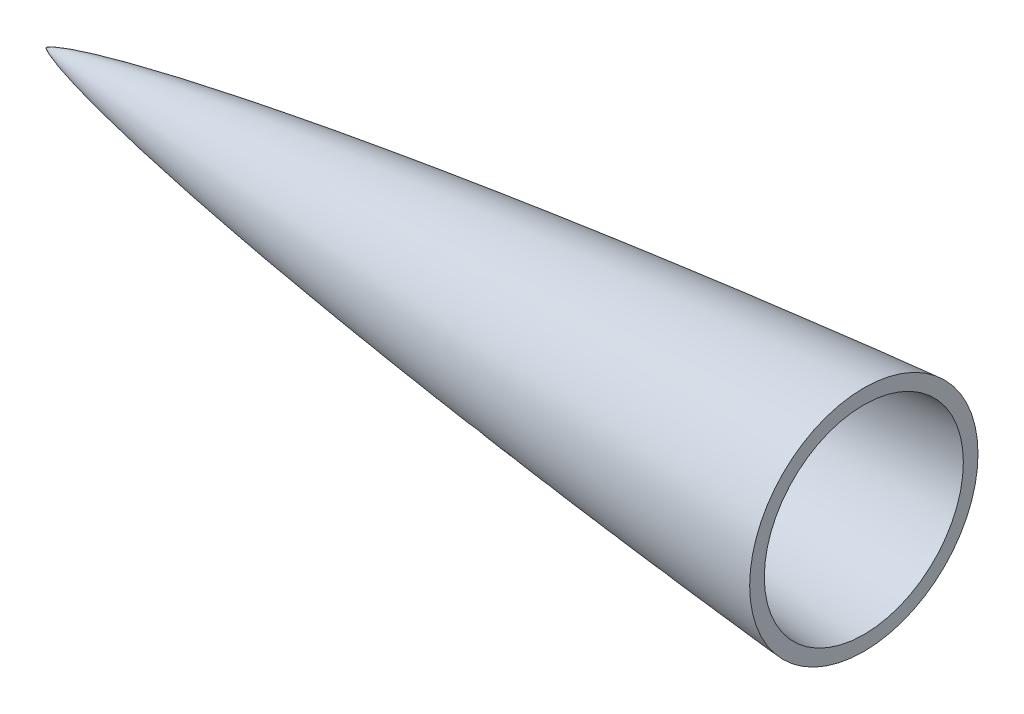
ISO-10303-21;
HEADER;
FILE_DESCRIPTION(('STEP AP214'),'2;1');
FILE_NAME('part.step','',(''),(''),'','','');
FILE_SCHEMA(('AUTOMOTIVE_DESIGN { 1 0 10303 214 1 1 1 1 }'));
ENDSEC;
DATA;
#1=APPLICATION_CONTEXT('core data for automotive mechanical design processes');
#2=APPLICATION_PROTOCOL_DEFINITION('international standard','automotive_design',2000,#1);
#3=PRODUCT_CONTEXT('',#1,'mechanical');
#4=PRODUCT('Part','Part','',(#3));
#5=PRODUCT_RELATED_PRODUCT_CATEGORY('part','',(#4));
#6=PRODUCT_DEFINITION_FORMATION('','',#4);
#7=PRODUCT_DEFINITION_CONTEXT('part definition',#1,'design');
#8=PRODUCT_DEFINITION('design','',#6,#7);
#9=PRODUCT_DEFINITION_SHAPE('','',#8);
#10=(LENGTH_UNIT() NAMED_UNIT(*) SI_UNIT(.MILLI.,.METRE.));
#11=(NAMED_UNIT(*) PLANE_ANGLE_UNIT() SI_UNIT($,.RADIAN.));
#12=(NAMED_UNIT(*) SI_UNIT($,.STERADIAN.) SOLID_ANGLE_UNIT());
#13=UNCERTAINTY_MEASURE_WITH_UNIT(LENGTH_MEASURE(1.E-05),#10,'distance_accuracy_value','');
#14=(GEOMETRIC_REPRESENTATION_CONTEXT(3) GLOBAL_UNCERTAINTY_ASSIGNED_CONTEXT((#13)) GLOBAL_UNIT_ASSIGNED_CONTEXT((#10,
#11,#12)) REPRESENTATION_CONTEXT('',''));
#15=CARTESIAN_POINT('',(0.,0.,0.));
#16=DIRECTION('',(0.,0.,1.));
#17=DIRECTION('',(1.,0.,0.));
#18=AXIS2_PLACEMENT_3D('',#15,#16,#17);
#19=CARTESIAN_POINT('',(355.6,0.,0.));
#20=DIRECTION('',(1.,0.,0.));
#21=DIRECTION('',(0.,0.,-1.));
#22=AXIS2_PLACEMENT_3D('',#19,#20,#21);
#23=PLANE('',#22);
#24=CARTESIAN_POINT('',(355.6,0.,0.));
#25=DIRECTION('',(-1.,0.,0.));
#26=DIRECTION('',(0.,0.,1.));
#27=AXIS2_PLACEMENT_3D('',#24,#25,#26);
#28=CIRCLE('',#27,49.6479861284665);
#29=CARTESIAN_POINT('',(355.6,0.,49.6479861284665));
#30=VERTEX_POINT('',#29);
#31=EDGE_CURVE('E56',#30,#30,#28,.F.);
#32=ORIENTED_EDGE('',*,*,#31,.T.);
#33=EDGE_LOOP('',(#32));
#34=FACE_BOUND('',#33,.T.);
#35=CARTESIAN_POINT('',(355.599999999998,0.,0.));
#36=DIRECTION('',(-1.,0.,0.));
#37=DIRECTION('',(0.,0.,1.));
#38=AXIS2_PLACEMENT_3D('',#35,#36,#37);
#39=CIRCLE('',#38,43.2746516786315);
#40=CARTESIAN_POINT('',(355.599999999998,0.,43.2746516786315));
#41=VERTEX_POINT('',#40);
#42=EDGE_CURVE('E11',#41,#41,#39,.F.);
#43=ORIENTED_EDGE('',*,*,#42,.F.);
#44=EDGE_LOOP('',(#43));
#45=FACE_BOUND('',#44,.T.);
#46=ADVANCED_FACE('F45',(#34,#45),#23,.T.);
#47=CARTESIAN_POINT('',(635.,65.405,0.));
#48=CARTESIAN_POINT('',(632.980968041376,65.3999049079982,0.));
#49=CARTESIAN_POINT('',(628.943051518666,65.3607987649682,0.));
#50=CARTESIAN_POINT('',(620.867800743739,65.238425835158,0.));
#51=CARTESIAN_POINT('',(607.876612197197,64.9420444267635,0.));
#52=CARTESIAN_POINT('',(591.989866173885,64.4665825864284,0.));
#53=CARTESIAN_POINT('',(568.294487812533,63.5924578117391,0.));
#54=CARTESIAN_POINT('',(538.814064527861,62.2664605978091,0.));
#55=CARTESIAN_POINT('',(504.434100625351,60.4361863708921,0.));
#56=CARTESIAN_POINT('',(465.161890456531,58.0127528854532,0.));
#57=CARTESIAN_POINT('',(425.909385737502,55.2895252497301,0.));
#58=CARTESIAN_POINT('',(386.677550901074,52.2836135264071,0.));
#59=CARTESIAN_POINT('',(347.46776242828,49.0025673324941,0.));
#60=CARTESIAN_POINT('',(308.282068325667,45.4454012222465,0.));
#61=CARTESIAN_POINT('',(269.123174714222,41.6037605555624,0.));
#62=CARTESIAN_POINT('',(229.995170684784,37.4592339547084,0.));
#63=CARTESIAN_POINT('',(190.90356887878,32.9826992551564,0.));
#64=CARTESIAN_POINT('',(151.857530337521,28.1241973222402,0.));
#65=CARTESIAN_POINT('',(112.870807325211,22.8061369351955,0.));
#66=CARTESIAN_POINT('',(77.9573287846358,17.4873019784259,0.));
#67=CARTESIAN_POINT('',(49.1787935546804,12.5135793040533,0.));
#68=CARTESIAN_POINT('',(28.2617417770008,8.30499279351691,0.));
#69=CARTESIAN_POINT('',(16.0220282949449,5.44625020056791,0.));
#70=CARTESIAN_POINT('',(8.93318062814798,3.51548578780447,0.));
#71=CARTESIAN_POINT('',(5.16339541485639,2.32840347516785,0.));
#72=CARTESIAN_POINT('',(3.11582679923173,1.59218900684347,0.));
#73=CARTESIAN_POINT('',(1.97027691704133,1.1275016191836,0.));
#74=CARTESIAN_POINT('',(1.33181141167439,0.839140676757945,0.));
#75=CARTESIAN_POINT('',(0.95671602904962,0.653660621097922,0.));
#76=CARTESIAN_POINT('',(0.715531562152649,0.525146597932932,0.));
#77=CARTESIAN_POINT('',(0.550210431495335,0.431764809009291,0.));
#78=CARTESIAN_POINT('',(0.406270251751136,0.344359984283262,0.));
#79=CARTESIAN_POINT('',(0.283649615611126,0.263361482709997,0.));
#80=CARTESIAN_POINT('',(0.181602895816827,0.18888943286587,0.));
#81=CARTESIAN_POINT('',(0.109817079168359,0.130424863371353,0.));
#82=CARTESIAN_POINT('',(0.0569836765196351,0.0804262546774983,0.));
#83=CARTESIAN_POINT('',(0.0222716682134025,0.0403845586316774,0.));
#84=CARTESIAN_POINT('',(0.00752296936524731,0.0183675987536798,0.));
#85=CARTESIAN_POINT('',(0.00219211488346488,0.0062902080222314,0.));
#86=CARTESIAN_POINT('',(0.,0.,0.));
#87=B_SPLINE_CURVE_WITH_KNOTS('',4,(#47,#48,#49,#50,#51,#52,#53,#54,#55,#56,#57,#58,#59,#60,#61,
#62,#63,#64,#65,#66,#67,#68,#69,#70,#71,#72,#73,#74,#75,#76,#77,#78,#79,#80,#81,#82,#83,#84,#85,
#86),.UNSPECIFIED.,.F.,.F.,(5,1,1,1,1,1,1,1,1,1,1,1,1,1,1,1,1,1,1,1,1,1,1,1,1,1,1,1,1,1,1,1,1,1,
1,1,5),(0.,0.0126278600836156,0.0252557201672313,0.0505114403344626,0.0812725997628029,
0.112033759191143,0.173556078208551,0.235078396298971,0.296600715210933,0.358123034494872,
0.419645352372099,0.481167670690979,0.542689989321029,0.604212308113024,0.665734626856386,
0.727256945203041,0.788779262537685,0.850301578000527,0.911823895791277,0.948128969524394,
0.971421118017023,0.983729988096585,0.990421707276453,0.994070390445943,0.996134035175531,
0.997335608030765,0.998151497389768,0.998451073952135,0.998750650514502,0.999044750264593,
0.999338850014684,0.999504137511013,0.999669425007342,0.999834712503671,0.999917356251836,
0.999958678125918,1.),.UNSPECIFIED.);
#88=CARTESIAN_POINT('',(0.,0.,0.));
#89=DIRECTION('',(-1.,0.,0.));
#90=AXIS1_PLACEMENT('',#88,#89);
#91=SURFACE_OF_REVOLUTION('',#87,#90);
#92=CARTESIAN_POINT('',(0.,0.,0.));
#93=VERTEX_POINT('',#92);
#94=VERTEX_LOOP('',#93);
#95=FACE_BOUND('',#94,.T.);
#96=ORIENTED_EDGE('',*,*,#31,.F.);
#97=EDGE_LOOP('',(#96));
#98=FACE_BOUND('',#97,.T.);
#99=ADVANCED_FACE('F66',(#95,#98),#91,.T.);
#100=CARTESIAN_POINT('',(635.,65.405,0.));
#101=CARTESIAN_POINT('',(632.980968041376,65.3999049079982,0.));
#102=CARTESIAN_POINT('',(628.943051518666,65.3607987649682,0.));
#103=CARTESIAN_POINT('',(620.867800743739,65.238425835158,0.));
#104=CARTESIAN_POINT('',(607.876612197197,64.9420444267635,0.));
#105=CARTESIAN_POINT('',(591.989866173885,64.4665825864284,0.));
#106=CARTESIAN_POINT('',(568.294487812533,63.5924578117391,0.));
#107=CARTESIAN_POINT('',(538.814064527861,62.2664605978091,0.));
#108=CARTESIAN_POINT('',(504.434100625351,60.4361863708921,0.));
#109=CARTESIAN_POINT('',(465.161890456531,58.0127528854532,0.));
#110=CARTESIAN_POINT('',(425.909385737502,55.2895252497301,0.));
#111=CARTESIAN_POINT('',(386.677550901074,52.2836135264071,0.));
#112=CARTESIAN_POINT('',(347.46776242828,49.0025673324941,0.));
#113=CARTESIAN_POINT('',(308.282068325667,45.4454012222465,0.));
#114=CARTESIAN_POINT('',(269.123174714222,41.6037605555624,0.));
#115=CARTESIAN_POINT('',(229.995170684784,37.4592339547084,0.));
#116=CARTESIAN_POINT('',(190.90356887878,32.9826992551564,0.));
#117=CARTESIAN_POINT('',(151.857530337521,28.1241973222402,0.));
#118=CARTESIAN_POINT('',(112.870807325211,22.8061369351955,0.));
#119=CARTESIAN_POINT('',(77.9573287846358,17.4873019784259,0.));
#120=CARTESIAN_POINT('',(49.691922506701,12.6022621047292,0.));
#121=CARTESIAN_POINT('',(31.2124598134355,8.89829644794129,0.));
#122=CARTESIAN_POINT('',(22.4234973059566,6.91999826072989,0.));
#123=CARTESIAN_POINT('',(19.3075240312599,6.17668852516933,0.));
#124=B_SPLINE_CURVE_WITH_KNOTS('',4,(#100,#101,#102,#103,#104,#105,#106,#107,#108,#109,#110,
#111,#112,#113,#114,#115,#116,#117,#118,#119,#120,#121,#122,#123),.UNSPECIFIED.,.F.,.F.,(5,1,1,
1,1,1,1,1,1,1,1,1,1,1,1,1,1,1,1,1,5),(0.,0.0126278600836156,0.0252557201672313,
0.0505114403344626,0.0812725997628029,0.112033759191143,0.173556078208551,0.235078396298971,
0.296600715210933,0.358123034494872,0.419645352372099,0.481167670690979,0.542689989321029,
0.604212308113024,0.665734626856386,0.727256945203041,0.788779262537685,0.850301578000527,
0.911823895791277,0.948128969524394,0.968164565063639),.UNSPECIFIED.);
#125=CARTESIAN_POINT('',(0.,0.,0.));
#126=DIRECTION('',(-1.,0.,0.));
#127=AXIS1_PLACEMENT('',#125,#126);
#128=SURFACE_OF_REVOLUTION('',#124,#127);
#129=OFFSET_SURFACE('',#128,-6.35,.F.);
#130=CARTESIAN_POINT('',(20.7809618015921,0.,0.));
#131=VERTEX_POINT('',#130);
#132=VERTEX_LOOP('',#131);
#133=FACE_BOUND('',#132,.T.);
#134=ORIENTED_EDGE('',*,*,#42,.T.);
#135=EDGE_LOOP('',(#134));
#136=FACE_BOUND('',#135,.T.);
#137=ADVANCED_FACE('F63',(#133,#136),#129,.F.);
#138=CLOSED_SHELL('',(#46,#99,#137));
#139=MANIFOLD_SOLID_BREP('B2',#138);
#140=ADVANCED_BREP_SHAPE_REPRESENTATION('',(#18,#139),#14);
#141=SHAPE_DEFINITION_REPRESENTATION(#9,#140);
ENDSEC;
END-ISO-10303-21;
